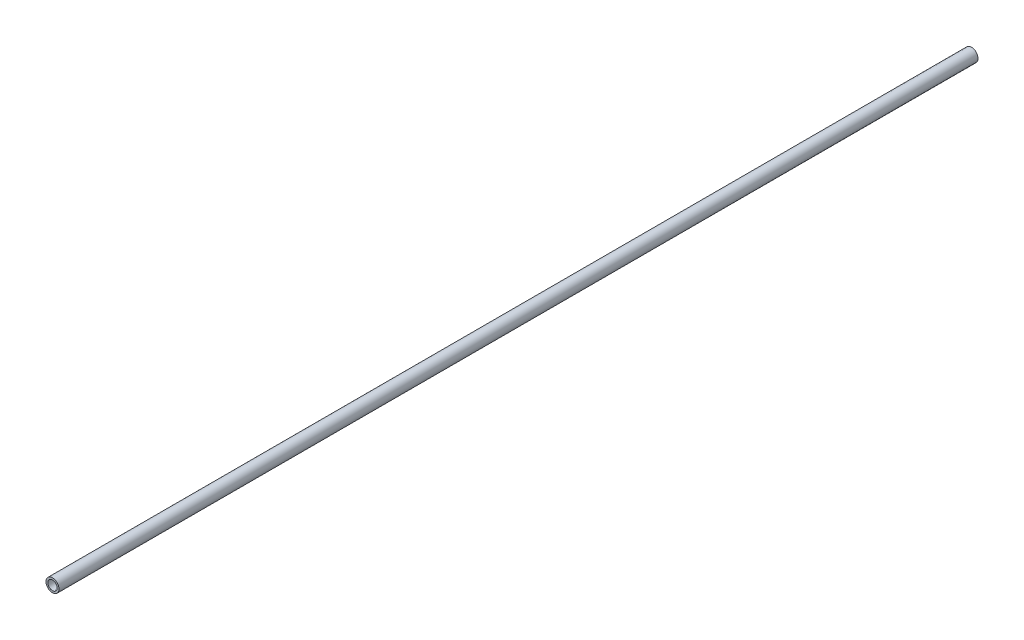
ISO-10303-21;
HEADER;
FILE_DESCRIPTION(('STEP AP214'),'2;1');
FILE_NAME('part.step','',(''),(''),'','','');
FILE_SCHEMA(('AUTOMOTIVE_DESIGN { 1 0 10303 214 1 1 1 1 }'));
ENDSEC;
DATA;
#1=APPLICATION_CONTEXT('core data for automotive mechanical design processes');
#2=APPLICATION_PROTOCOL_DEFINITION('international standard','automotive_design',2000,#1);
#3=PRODUCT_CONTEXT('',#1,'mechanical');
#4=PRODUCT('Part','Part','',(#3));
#5=PRODUCT_RELATED_PRODUCT_CATEGORY('part','',(#4));
#6=PRODUCT_DEFINITION_FORMATION('','',#4);
#7=PRODUCT_DEFINITION_CONTEXT('part definition',#1,'design');
#8=PRODUCT_DEFINITION('design','',#6,#7);
#9=PRODUCT_DEFINITION_SHAPE('','',#8);
#10=(LENGTH_UNIT() NAMED_UNIT(*) SI_UNIT(.MILLI.,.METRE.));
#11=(NAMED_UNIT(*) PLANE_ANGLE_UNIT() SI_UNIT($,.RADIAN.));
#12=(NAMED_UNIT(*) SI_UNIT($,.STERADIAN.) SOLID_ANGLE_UNIT());
#13=UNCERTAINTY_MEASURE_WITH_UNIT(LENGTH_MEASURE(1.E-05),#10,'distance_accuracy_value','');
#14=(GEOMETRIC_REPRESENTATION_CONTEXT(3) GLOBAL_UNCERTAINTY_ASSIGNED_CONTEXT((#13)) GLOBAL_UNIT_ASSIGNED_CONTEXT((#10,
#11,#12)) REPRESENTATION_CONTEXT('',''));
#15=CARTESIAN_POINT('',(0.,0.,0.));
#16=DIRECTION('',(0.,0.,1.));
#17=DIRECTION('',(1.,0.,0.));
#18=AXIS2_PLACEMENT_3D('',#15,#16,#17);
#19=CARTESIAN_POINT('',(203.532679810109,-1.77586104901152,-495.));
#20=DIRECTION('',(0.,0.,1.));
#21=DIRECTION('',(1.,0.,0.));
#22=AXIS2_PLACEMENT_3D('',#19,#20,#21);
#23=CYLINDRICAL_SURFACE('',#22,3.49999999999999);
#24=CARTESIAN_POINT('',(203.532679810109,-1.77586104901152,-495.));
#25=DIRECTION('',(0.,0.,1.));
#26=DIRECTION('',(1.,0.,0.));
#27=AXIS2_PLACEMENT_3D('',#24,#25,#26);
#28=CIRCLE('',#27,3.49999999999999);
#29=CARTESIAN_POINT('',(207.032679810109,-1.77586104901152,-495.));
#30=VERTEX_POINT('',#29);
#31=EDGE_CURVE('E10',#30,#30,#28,.T.);
#32=ORIENTED_EDGE('',*,*,#31,.T.);
#33=EDGE_LOOP('',(#32));
#34=FACE_BOUND('',#33,.T.);
#35=CARTESIAN_POINT('',(203.532679810109,-1.77586104901152,0.));
#36=DIRECTION('',(0.,0.,1.));
#37=DIRECTION('',(1.,0.,0.));
#38=AXIS2_PLACEMENT_3D('',#35,#36,#37);
#39=CIRCLE('',#38,3.49999999999999);
#40=CARTESIAN_POINT('',(207.032679810109,-1.77586104901152,0.));
#41=VERTEX_POINT('',#40);
#42=EDGE_CURVE('E40',#41,#41,#39,.T.);
#43=ORIENTED_EDGE('',*,*,#42,.F.);
#44=EDGE_LOOP('',(#43));
#45=FACE_BOUND('',#44,.T.);
#46=ADVANCED_FACE('F37',(#34,#45),#23,.T.);
#47=CARTESIAN_POINT('',(203.532679810109,-1.77586104901152,-495.));
#48=DIRECTION('',(0.,0.,1.));
#49=DIRECTION('',(1.,0.,0.));
#50=AXIS2_PLACEMENT_3D('',#47,#48,#49);
#51=PLANE('',#50);
#52=CARTESIAN_POINT('',(203.532679810109,-1.77586104901152,-495.));
#53=DIRECTION('',(0.,0.,1.));
#54=DIRECTION('',(1.,0.,0.));
#55=AXIS2_PLACEMENT_3D('',#52,#53,#54);
#56=CIRCLE('',#55,2.5);
#57=CARTESIAN_POINT('',(206.032679810109,-1.77586104901152,-495.));
#58=VERTEX_POINT('',#57);
#59=EDGE_CURVE('E52',#58,#58,#56,.T.);
#60=ORIENTED_EDGE('',*,*,#59,.T.);
#61=EDGE_LOOP('',(#60));
#62=FACE_BOUND('',#61,.T.);
#63=ORIENTED_EDGE('',*,*,#31,.F.);
#64=EDGE_LOOP('',(#63));
#65=FACE_BOUND('',#64,.T.);
#66=ADVANCED_FACE('F63',(#62,#65),#51,.F.);
#67=CARTESIAN_POINT('',(203.532679810109,-1.77586104901152,0.));
#68=DIRECTION('',(0.,0.,1.));
#69=DIRECTION('',(1.,0.,0.));
#70=AXIS2_PLACEMENT_3D('',#67,#68,#69);
#71=PLANE('',#70);
#72=CARTESIAN_POINT('',(203.532679810109,-1.77586104901152,0.));
#73=DIRECTION('',(0.,0.,1.));
#74=DIRECTION('',(1.,0.,0.));
#75=AXIS2_PLACEMENT_3D('',#72,#73,#74);
#76=CIRCLE('',#75,2.5);
#77=CARTESIAN_POINT('',(206.032679810109,-1.77586104901152,0.));
#78=VERTEX_POINT('',#77);
#79=EDGE_CURVE('E54',#78,#78,#76,.T.);
#80=ORIENTED_EDGE('',*,*,#79,.F.);
#81=EDGE_LOOP('',(#80));
#82=FACE_BOUND('',#81,.T.);
#83=ORIENTED_EDGE('',*,*,#42,.T.);
#84=EDGE_LOOP('',(#83));
#85=FACE_BOUND('',#84,.T.);
#86=ADVANCED_FACE('F69',(#82,#85),#71,.T.);
#87=CARTESIAN_POINT('',(203.532679810109,-1.77586104901152,-495.));
#88=DIRECTION('',(0.,0.,1.));
#89=DIRECTION('',(1.,0.,0.));
#90=AXIS2_PLACEMENT_3D('',#87,#88,#89);
#91=CYLINDRICAL_SURFACE('',#90,2.5);
#92=ORIENTED_EDGE('',*,*,#59,.F.);
#93=EDGE_LOOP('',(#92));
#94=FACE_BOUND('',#93,.T.);
#95=ORIENTED_EDGE('',*,*,#79,.T.);
#96=EDGE_LOOP('',(#95));
#97=FACE_BOUND('',#96,.T.);
#98=ADVANCED_FACE('F66',(#94,#97),#91,.F.);
#99=CLOSED_SHELL('',(#46,#66,#86,#98));
#100=MANIFOLD_SOLID_BREP('B2',#99);
#101=ADVANCED_BREP_SHAPE_REPRESENTATION('',(#18,#100),#14);
#102=SHAPE_DEFINITION_REPRESENTATION(#9,#101);
ENDSEC;
END-ISO-10303-21;
